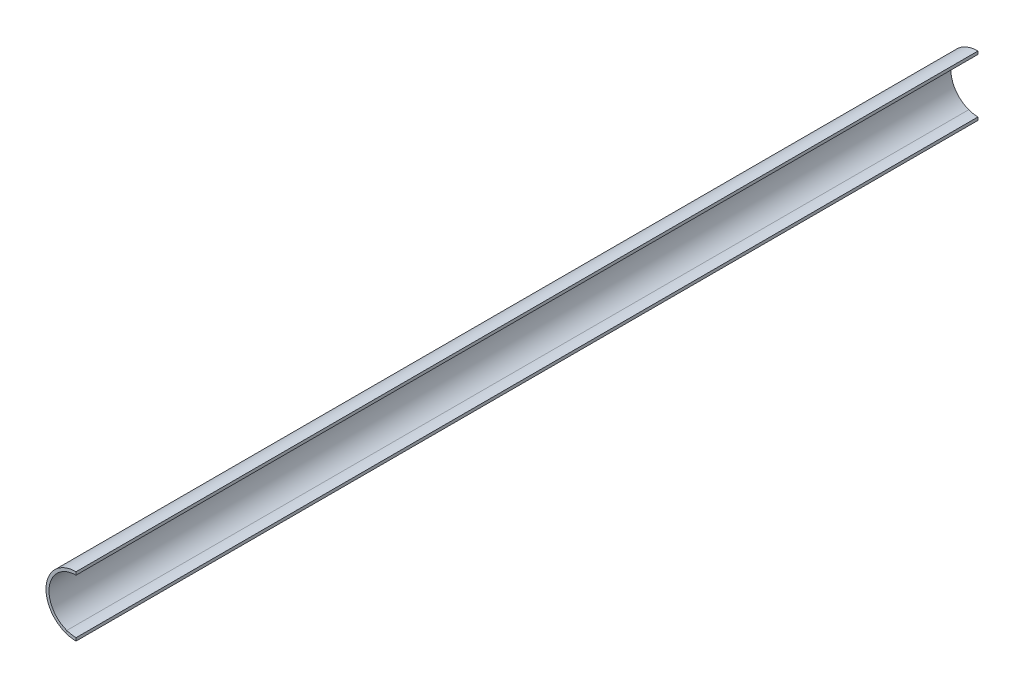
ISO-10303-21;
HEADER;
FILE_DESCRIPTION(('STEP AP214'),'2;1');
FILE_NAME('part.step','',(''),(''),'','','');
FILE_SCHEMA(('AUTOMOTIVE_DESIGN { 1 0 10303 214 1 1 1 1 }'));
ENDSEC;
DATA;
#1=APPLICATION_CONTEXT('core data for automotive mechanical design processes');
#2=APPLICATION_PROTOCOL_DEFINITION('international standard','automotive_design',2000,#1);
#3=PRODUCT_CONTEXT('',#1,'mechanical');
#4=PRODUCT('Part','Part','',(#3));
#5=PRODUCT_RELATED_PRODUCT_CATEGORY('part','',(#4));
#6=PRODUCT_DEFINITION_FORMATION('','',#4);
#7=PRODUCT_DEFINITION_CONTEXT('part definition',#1,'design');
#8=PRODUCT_DEFINITION('design','',#6,#7);
#9=PRODUCT_DEFINITION_SHAPE('','',#8);
#10=(LENGTH_UNIT() NAMED_UNIT(*) SI_UNIT(.MILLI.,.METRE.));
#11=(NAMED_UNIT(*) PLANE_ANGLE_UNIT() SI_UNIT($,.RADIAN.));
#12=(NAMED_UNIT(*) SI_UNIT($,.STERADIAN.) SOLID_ANGLE_UNIT());
#13=UNCERTAINTY_MEASURE_WITH_UNIT(LENGTH_MEASURE(1.E-05),#10,'distance_accuracy_value','');
#14=(GEOMETRIC_REPRESENTATION_CONTEXT(3) GLOBAL_UNCERTAINTY_ASSIGNED_CONTEXT((#13)) GLOBAL_UNIT_ASSIGNED_CONTEXT((#10,
#11,#12)) REPRESENTATION_CONTEXT('',''));
#15=CARTESIAN_POINT('',(0.,0.,0.));
#16=DIRECTION('',(0.,0.,1.));
#17=DIRECTION('',(1.,0.,0.));
#18=AXIS2_PLACEMENT_3D('',#15,#16,#17);
#19=CARTESIAN_POINT('',(0.,0.,300.));
#20=DIRECTION('',(0.,0.,-1.));
#21=DIRECTION('',(-1.,0.,0.));
#22=AXIS2_PLACEMENT_3D('',#19,#20,#21);
#23=CYLINDRICAL_SURFACE('',#22,9.);
#24=CARTESIAN_POINT('',(0.,0.,0.));
#25=DIRECTION('',(0.,0.,-1.));
#26=DIRECTION('',(1.,0.,0.));
#27=AXIS2_PLACEMENT_3D('',#24,#25,#26);
#28=CIRCLE('',#27,9.);
#29=CARTESIAN_POINT('',(0.,-9.,0.));
#30=VERTEX_POINT('',#29);
#31=CARTESIAN_POINT('',(-3.07818128993102,-8.45723358707317,0.));
#32=VERTEX_POINT('',#31);
#33=EDGE_CURVE('E134',#30,#32,#28,.T.);
#34=ORIENTED_EDGE('',*,*,#33,.T.);
#35=DIRECTION('',(0.,0.,1.));
#36=VECTOR('',#35,1.);
#37=CARTESIAN_POINT('',(-3.07818128993102,-8.45723358707317,300.));
#38=LINE('',#37,#36);
#39=CARTESIAN_POINT('',(-3.07818128993102,-8.45723358707317,300.));
#40=VERTEX_POINT('',#39);
#41=EDGE_CURVE('E12',#32,#40,#38,.T.);
#42=ORIENTED_EDGE('',*,*,#41,.T.);
#43=CARTESIAN_POINT('',(0.,0.,300.));
#44=DIRECTION('',(0.,0.,-1.));
#45=DIRECTION('',(1.,0.,0.));
#46=AXIS2_PLACEMENT_3D('',#43,#44,#45);
#47=CIRCLE('',#46,9.);
#48=CARTESIAN_POINT('',(0.,-9.,300.));
#49=VERTEX_POINT('',#48);
#50=EDGE_CURVE('E105',#49,#40,#47,.T.);
#51=ORIENTED_EDGE('',*,*,#50,.F.);
#52=DIRECTION('',(0.,0.,-1.));
#53=VECTOR('',#52,1.);
#54=CARTESIAN_POINT('',(0.,-9.,300.));
#55=LINE('',#54,#53);
#56=EDGE_CURVE('E125',#49,#30,#55,.T.);
#57=ORIENTED_EDGE('',*,*,#56,.T.);
#58=EDGE_LOOP('',(#34,#42,#51,#57));
#59=FACE_BOUND('',#58,.T.);
#60=ADVANCED_FACE('F44',(#59),#23,.F.);
#61=CARTESIAN_POINT('',(0.,0.,300.));
#62=DIRECTION('',(0.,0.,1.));
#63=DIRECTION('',(1.,0.,0.));
#64=AXIS2_PLACEMENT_3D('',#61,#62,#63);
#65=PLANE('',#64);
#66=CARTESIAN_POINT('',(0.,0.,300.));
#67=DIRECTION('',(0.,0.,1.));
#68=DIRECTION('',(1.,0.,0.));
#69=AXIS2_PLACEMENT_3D('',#66,#67,#68);
#70=CIRCLE('',#69,10.);
#71=CARTESIAN_POINT('',(0.,10.,300.));
#72=VERTEX_POINT('',#71);
#73=CARTESIAN_POINT('',(-3.42020143325669,-9.39692620785908,300.));
#74=VERTEX_POINT('',#73);
#75=EDGE_CURVE('E138',#72,#74,#70,.T.);
#76=ORIENTED_EDGE('',*,*,#75,.T.);
#77=DIRECTION('',(0.342020143325669,0.939692620785908,0.));
#78=VECTOR('',#77,1.);
#79=CARTESIAN_POINT('',(0.,0.,300.));
#80=LINE('',#79,#78);
#81=EDGE_CURVE('E52',#74,#40,#80,.T.);
#82=ORIENTED_EDGE('',*,*,#81,.T.);
#83=CARTESIAN_POINT('',(0.,9.,300.));
#84=VERTEX_POINT('',#83);
#85=EDGE_CURVE('E98',#40,#84,#47,.T.);
#86=ORIENTED_EDGE('',*,*,#85,.T.);
#87=DIRECTION('',(0.,1.,0.));
#88=VECTOR('',#87,1.);
#89=CARTESIAN_POINT('',(0.,10.,300.));
#90=LINE('',#89,#88);
#91=EDGE_CURVE('E102',#84,#72,#90,.T.);
#92=ORIENTED_EDGE('',*,*,#91,.T.);
#93=EDGE_LOOP('',(#76,#82,#86,#92));
#94=FACE_BOUND('',#93,.T.);
#95=ADVANCED_FACE('F101',(#94),#65,.T.);
#96=ORIENTED_EDGE('',*,*,#41,.F.);
#97=CARTESIAN_POINT('',(0.,9.,0.));
#98=VERTEX_POINT('',#97);
#99=EDGE_CURVE('E117',#32,#98,#28,.T.);
#100=ORIENTED_EDGE('',*,*,#99,.T.);
#101=DIRECTION('',(0.,0.,-1.));
#102=VECTOR('',#101,1.);
#103=CARTESIAN_POINT('',(0.,9.,300.));
#104=LINE('',#103,#102);
#105=EDGE_CURVE('E111',#84,#98,#104,.T.);
#106=ORIENTED_EDGE('',*,*,#105,.F.);
#107=ORIENTED_EDGE('',*,*,#85,.F.);
#108=EDGE_LOOP('',(#96,#100,#106,#107));
#109=FACE_BOUND('',#108,.T.);
#110=ADVANCED_FACE('F46',(#109),#23,.F.);
#111=CARTESIAN_POINT('',(0.,10.,300.));
#112=DIRECTION('',(-1.,0.,0.));
#113=DIRECTION('',(0.,-1.,0.));
#114=AXIS2_PLACEMENT_3D('',#111,#112,#113);
#115=PLANE('',#114);
#116=DIRECTION('',(0.,1.,0.));
#117=VECTOR('',#116,1.);
#118=CARTESIAN_POINT('',(0.,10.,0.));
#119=LINE('',#118,#117);
#120=CARTESIAN_POINT('',(0.,10.,0.));
#121=VERTEX_POINT('',#120);
#122=EDGE_CURVE('E132',#98,#121,#119,.T.);
#123=ORIENTED_EDGE('',*,*,#122,.T.);
#124=DIRECTION('',(0.,0.,-1.));
#125=VECTOR('',#124,1.);
#126=CARTESIAN_POINT('',(0.,10.,300.));
#127=LINE('',#126,#125);
#128=EDGE_CURVE('E113',#72,#121,#127,.T.);
#129=ORIENTED_EDGE('',*,*,#128,.F.);
#130=ORIENTED_EDGE('',*,*,#91,.F.);
#131=ORIENTED_EDGE('',*,*,#105,.T.);
#132=EDGE_LOOP('',(#123,#129,#130,#131));
#133=FACE_BOUND('',#132,.T.);
#134=ADVANCED_FACE('F110',(#133),#115,.F.);
#135=CARTESIAN_POINT('',(0.,0.,300.));
#136=DIRECTION('',(0.,0.,-1.));
#137=DIRECTION('',(-1.,0.,0.));
#138=AXIS2_PLACEMENT_3D('',#135,#136,#137);
#139=CYLINDRICAL_SURFACE('',#138,10.);
#140=CARTESIAN_POINT('',(0.,0.,0.));
#141=DIRECTION('',(0.,0.,1.));
#142=DIRECTION('',(1.,0.,0.));
#143=AXIS2_PLACEMENT_3D('',#140,#141,#142);
#144=CIRCLE('',#143,10.);
#145=CARTESIAN_POINT('',(0.,-10.,0.));
#146=VERTEX_POINT('',#145);
#147=EDGE_CURVE('E130',#121,#146,#144,.T.);
#148=ORIENTED_EDGE('',*,*,#147,.T.);
#149=DIRECTION('',(0.,0.,-1.));
#150=VECTOR('',#149,1.);
#151=CARTESIAN_POINT('',(0.,-10.,300.));
#152=LINE('',#151,#150);
#153=CARTESIAN_POINT('',(0.,-10.,300.));
#154=VERTEX_POINT('',#153);
#155=EDGE_CURVE('E120',#154,#146,#152,.T.);
#156=ORIENTED_EDGE('',*,*,#155,.F.);
#157=EDGE_CURVE('E115',#74,#154,#70,.T.);
#158=ORIENTED_EDGE('',*,*,#157,.F.);
#159=ORIENTED_EDGE('',*,*,#75,.F.);
#160=ORIENTED_EDGE('',*,*,#128,.T.);
#161=EDGE_LOOP('',(#148,#156,#158,#159,#160));
#162=FACE_BOUND('',#161,.T.);
#163=ADVANCED_FACE('F150',(#162),#139,.T.);
#164=CARTESIAN_POINT('',(0.,-9.,300.));
#165=DIRECTION('',(-1.,0.,0.));
#166=DIRECTION('',(0.,-1.,0.));
#167=AXIS2_PLACEMENT_3D('',#164,#165,#166);
#168=PLANE('',#167);
#169=DIRECTION('',(0.,1.,0.));
#170=VECTOR('',#169,1.);
#171=CARTESIAN_POINT('',(0.,-9.,0.));
#172=LINE('',#171,#170);
#173=EDGE_CURVE('E106',#146,#30,#172,.T.);
#174=ORIENTED_EDGE('',*,*,#173,.T.);
#175=ORIENTED_EDGE('',*,*,#56,.F.);
#176=DIRECTION('',(0.,1.,0.));
#177=VECTOR('',#176,1.);
#178=CARTESIAN_POINT('',(0.,-9.,300.));
#179=LINE('',#178,#177);
#180=EDGE_CURVE('E128',#154,#49,#179,.T.);
#181=ORIENTED_EDGE('',*,*,#180,.F.);
#182=ORIENTED_EDGE('',*,*,#155,.T.);
#183=EDGE_LOOP('',(#174,#175,#181,#182));
#184=FACE_BOUND('',#183,.T.);
#185=ADVANCED_FACE('F153',(#184),#168,.F.);
#186=ORIENTED_EDGE('',*,*,#81,.F.);
#187=ORIENTED_EDGE('',*,*,#157,.T.);
#188=ORIENTED_EDGE('',*,*,#180,.T.);
#189=ORIENTED_EDGE('',*,*,#50,.T.);
#190=EDGE_LOOP('',(#186,#187,#188,#189));
#191=FACE_BOUND('',#190,.T.);
#192=ADVANCED_FACE('F140',(#191),#65,.T.);
#193=CARTESIAN_POINT('',(0.,0.,0.));
#194=DIRECTION('',(0.,0.,1.));
#195=DIRECTION('',(1.,0.,0.));
#196=AXIS2_PLACEMENT_3D('',#193,#194,#195);
#197=PLANE('',#196);
#198=ORIENTED_EDGE('',*,*,#33,.F.);
#199=ORIENTED_EDGE('',*,*,#173,.F.);
#200=ORIENTED_EDGE('',*,*,#147,.F.);
#201=ORIENTED_EDGE('',*,*,#122,.F.);
#202=ORIENTED_EDGE('',*,*,#99,.F.);
#203=EDGE_LOOP('',(#198,#199,#200,#201,#202));
#204=FACE_BOUND('',#203,.T.);
#205=ADVANCED_FACE('F147',(#204),#197,.F.);
#206=CLOSED_SHELL('',(#60,#95,#110,#134,#163,#185,#192,#205));
#207=MANIFOLD_SOLID_BREP('B2',#206);
#208=ADVANCED_BREP_SHAPE_REPRESENTATION('',(#18,#207),#14);
#209=SHAPE_DEFINITION_REPRESENTATION(#9,#208);
ENDSEC;
END-ISO-10303-21;
